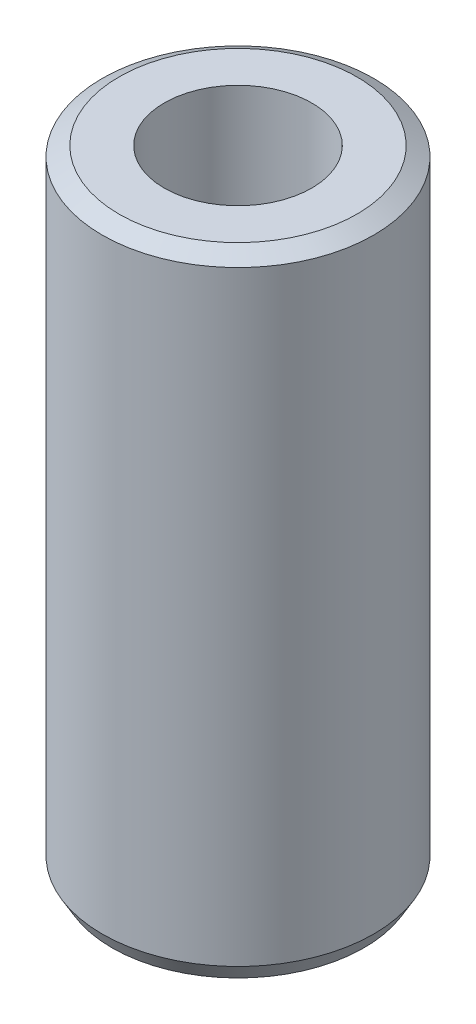
ISO-10303-21;
HEADER;
FILE_DESCRIPTION(('STEP AP214'),'2;1');
FILE_NAME('part.step','',(''),(''),'','','');
FILE_SCHEMA(('AUTOMOTIVE_DESIGN { 1 0 10303 214 1 1 1 1 }'));
ENDSEC;
DATA;
#1=APPLICATION_CONTEXT('core data for automotive mechanical design processes');
#2=APPLICATION_PROTOCOL_DEFINITION('international standard','automotive_design',2000,#1);
#3=PRODUCT_CONTEXT('',#1,'mechanical');
#4=PRODUCT('Part','Part','',(#3));
#5=PRODUCT_RELATED_PRODUCT_CATEGORY('part','',(#4));
#6=PRODUCT_DEFINITION_FORMATION('','',#4);
#7=PRODUCT_DEFINITION_CONTEXT('part definition',#1,'design');
#8=PRODUCT_DEFINITION('design','',#6,#7);
#9=PRODUCT_DEFINITION_SHAPE('','',#8);
#10=(LENGTH_UNIT() NAMED_UNIT(*) SI_UNIT(.MILLI.,.METRE.));
#11=(NAMED_UNIT(*) PLANE_ANGLE_UNIT() SI_UNIT($,.RADIAN.));
#12=(NAMED_UNIT(*) SI_UNIT($,.STERADIAN.) SOLID_ANGLE_UNIT());
#13=UNCERTAINTY_MEASURE_WITH_UNIT(LENGTH_MEASURE(1.E-05),#10,'distance_accuracy_value','');
#14=(GEOMETRIC_REPRESENTATION_CONTEXT(3) GLOBAL_UNCERTAINTY_ASSIGNED_CONTEXT((#13)) GLOBAL_UNIT_ASSIGNED_CONTEXT((#10,
#11,#12)) REPRESENTATION_CONTEXT('',''));
#15=CARTESIAN_POINT('',(0.,0.,0.));
#16=DIRECTION('',(0.,0.,1.));
#17=DIRECTION('',(1.,0.,0.));
#18=AXIS2_PLACEMENT_3D('',#15,#16,#17);
#19=CARTESIAN_POINT('',(0.,151.254654154904,0.));
#20=DIRECTION('',(0.,-1.,0.));
#21=DIRECTION('',(0.,0.,-1.));
#22=AXIS2_PLACEMENT_3D('',#19,#20,#21);
#23=CYLINDRICAL_SURFACE('',#22,32.5);
#24=CARTESIAN_POINT('',(0.,148.929342778626,0.));
#25=DIRECTION('',(0.,1.,0.));
#26=DIRECTION('',(0.,0.,1.));
#27=AXIS2_PLACEMENT_3D('',#24,#25,#26);
#28=CIRCLE('',#27,32.5);
#29=CARTESIAN_POINT('',(0.,148.929342778626,32.5));
#30=VERTEX_POINT('',#29);
#31=EDGE_CURVE('E50',#30,#30,#28,.F.);
#32=ORIENTED_EDGE('',*,*,#31,.T.);
#33=EDGE_LOOP('',(#32));
#34=FACE_BOUND('',#33,.T.);
#35=CARTESIAN_POINT('',(0.,4.0275574471309,0.));
#36=DIRECTION('',(0.,1.,0.));
#37=DIRECTION('',(0.,0.,1.));
#38=AXIS2_PLACEMENT_3D('',#35,#36,#37);
#39=CIRCLE('',#38,32.5);
#40=CARTESIAN_POINT('',(0.,4.0275574471309,32.5));
#41=VERTEX_POINT('',#40);
#42=EDGE_CURVE('E51',#41,#41,#39,.T.);
#43=ORIENTED_EDGE('',*,*,#42,.T.);
#44=EDGE_LOOP('',(#43));
#45=FACE_BOUND('',#44,.T.);
#46=ADVANCED_FACE('F39',(#34,#45),#23,.T.);
#47=CARTESIAN_POINT('',(0.,151.254654154904,0.));
#48=DIRECTION('',(0.,1.,0.));
#49=DIRECTION('',(0.,0.,1.));
#50=AXIS2_PLACEMENT_3D('',#47,#48,#49);
#51=PLANE('',#50);
#52=CARTESIAN_POINT('',(0.,151.254654154904,0.));
#53=DIRECTION('',(0.,1.,0.));
#54=DIRECTION('',(0.,0.,1.));
#55=AXIS2_PLACEMENT_3D('',#52,#53,#54);
#56=CIRCLE('',#55,28.4724425528691);
#57=CARTESIAN_POINT('',(0.,151.254654154904,28.4724425528691));
#58=VERTEX_POINT('',#57);
#59=EDGE_CURVE('E54',#58,#58,#56,.T.);
#60=ORIENTED_EDGE('',*,*,#59,.T.);
#61=EDGE_LOOP('',(#60));
#62=FACE_BOUND('',#61,.T.);
#63=CARTESIAN_POINT('',(0.,151.254654154904,0.));
#64=DIRECTION('',(0.,1.,0.));
#65=DIRECTION('',(0.,0.,1.));
#66=AXIS2_PLACEMENT_3D('',#63,#64,#65);
#67=CIRCLE('',#66,17.665957615004);
#68=CARTESIAN_POINT('',(0.,151.254654154904,17.665957615004));
#69=VERTEX_POINT('',#68);
#70=EDGE_CURVE('E58',#69,#69,#67,.T.);
#71=ORIENTED_EDGE('',*,*,#70,.F.);
#72=EDGE_LOOP('',(#71));
#73=FACE_BOUND('',#72,.T.);
#74=ADVANCED_FACE('F69',(#62,#73),#51,.T.);
#75=CARTESIAN_POINT('',(0.,0.,0.));
#76=DIRECTION('',(0.,1.,0.));
#77=DIRECTION('',(0.,0.,1.));
#78=AXIS2_PLACEMENT_3D('',#75,#76,#77);
#79=PLANE('',#78);
#80=CARTESIAN_POINT('',(0.,0.,0.));
#81=DIRECTION('',(0.,1.,0.));
#82=DIRECTION('',(0.,0.,1.));
#83=AXIS2_PLACEMENT_3D('',#80,#81,#82);
#84=CIRCLE('',#83,30.1746886237223);
#85=CARTESIAN_POINT('',(0.,0.,30.1746886237223));
#86=VERTEX_POINT('',#85);
#87=EDGE_CURVE('E10',#86,#86,#84,.F.);
#88=ORIENTED_EDGE('',*,*,#87,.T.);
#89=EDGE_LOOP('',(#88));
#90=FACE_BOUND('',#89,.T.);
#91=CARTESIAN_POINT('',(0.,0.,0.));
#92=DIRECTION('',(0.,1.,0.));
#93=DIRECTION('',(0.,0.,1.));
#94=AXIS2_PLACEMENT_3D('',#91,#92,#93);
#95=CIRCLE('',#94,17.665957615004);
#96=CARTESIAN_POINT('',(0.,0.,17.665957615004));
#97=VERTEX_POINT('',#96);
#98=EDGE_CURVE('E63',#97,#97,#95,.T.);
#99=ORIENTED_EDGE('',*,*,#98,.T.);
#100=EDGE_LOOP('',(#99));
#101=FACE_BOUND('',#100,.T.);
#102=ADVANCED_FACE('F75',(#90,#101),#79,.F.);
#103=CARTESIAN_POINT('',(0.,151.254654154904,0.));
#104=DIRECTION('',(0.,-1.,0.));
#105=DIRECTION('',(0.,0.,-1.));
#106=AXIS2_PLACEMENT_3D('',#103,#104,#105);
#107=CYLINDRICAL_SURFACE('',#106,17.665957615004);
#108=ORIENTED_EDGE('',*,*,#70,.T.);
#109=EDGE_LOOP('',(#108));
#110=FACE_BOUND('',#109,.T.);
#111=ORIENTED_EDGE('',*,*,#98,.F.);
#112=EDGE_LOOP('',(#111));
#113=FACE_BOUND('',#112,.T.);
#114=ADVANCED_FACE('F70',(#110,#113),#107,.F.);
#115=CARTESIAN_POINT('',(0.,151.254654154904,0.));
#116=DIRECTION('',(0.,-1.,0.));
#117=DIRECTION('',(0.,0.,-1.));
#118=AXIS2_PLACEMENT_3D('',#115,#116,#117);
#119=CONICAL_SURFACE('',#118,28.4724425528691,1.04719755119659);
#120=ORIENTED_EDGE('',*,*,#31,.F.);
#121=EDGE_LOOP('',(#120));
#122=FACE_BOUND('',#121,.T.);
#123=ORIENTED_EDGE('',*,*,#59,.F.);
#124=EDGE_LOOP('',(#123));
#125=FACE_BOUND('',#124,.T.);
#126=ADVANCED_FACE('F81',(#122,#125),#119,.T.);
#127=CARTESIAN_POINT('',(0.,4.0275574471309,0.));
#128=DIRECTION('',(0.,1.,0.));
#129=DIRECTION('',(0.,0.,1.));
#130=AXIS2_PLACEMENT_3D('',#127,#128,#129);
#131=CONICAL_SURFACE('',#130,32.5,0.523598775598301);
#132=ORIENTED_EDGE('',*,*,#87,.F.);
#133=EDGE_LOOP('',(#132));
#134=FACE_BOUND('',#133,.T.);
#135=ORIENTED_EDGE('',*,*,#42,.F.);
#136=EDGE_LOOP('',(#135));
#137=FACE_BOUND('',#136,.T.);
#138=ADVANCED_FACE('F45',(#134,#137),#131,.T.);
#139=CLOSED_SHELL('',(#46,#74,#102,#114,#126,#138));
#140=MANIFOLD_SOLID_BREP('B2',#139);
#141=ADVANCED_BREP_SHAPE_REPRESENTATION('',(#18,#140),#14);
#142=SHAPE_DEFINITION_REPRESENTATION(#9,#141);
ENDSEC;
END-ISO-10303-21;
